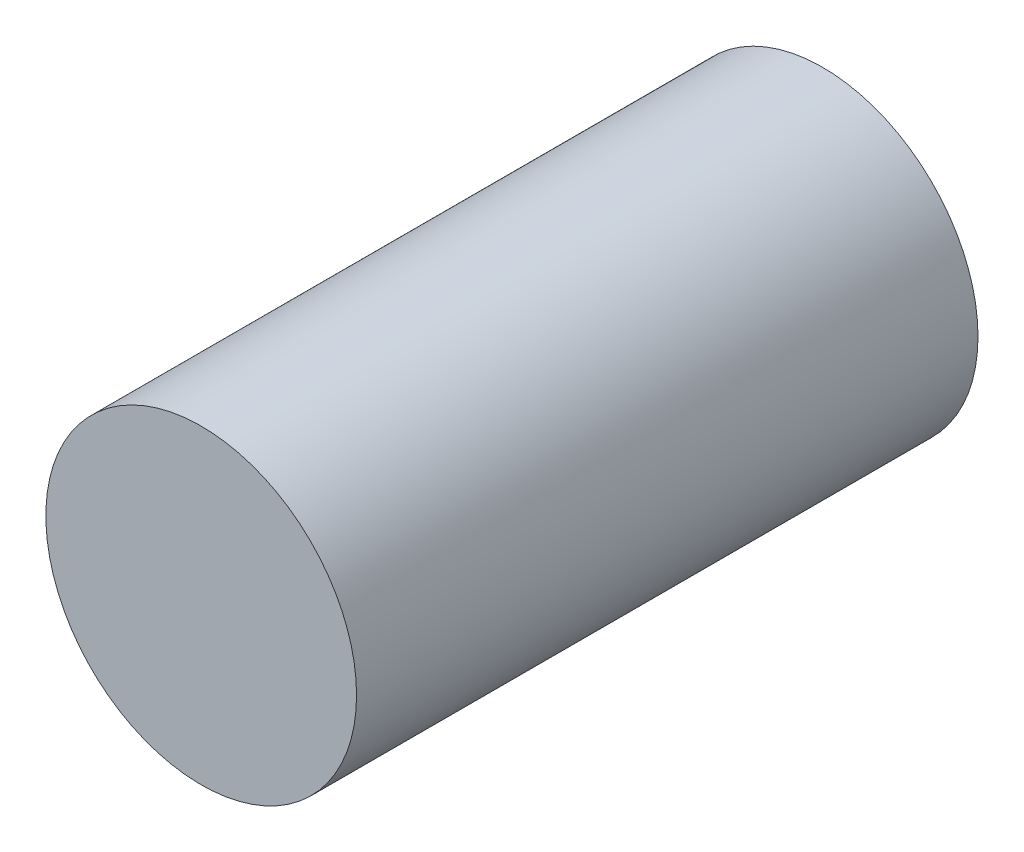
ISO-10303-21;
HEADER;
FILE_DESCRIPTION(('STEP AP214'),'2;1');
FILE_NAME('part.step','',(''),(''),'','','');
FILE_SCHEMA(('AUTOMOTIVE_DESIGN { 1 0 10303 214 1 1 1 1 }'));
ENDSEC;
DATA;
#1=APPLICATION_CONTEXT('core data for automotive mechanical design processes');
#2=APPLICATION_PROTOCOL_DEFINITION('international standard','automotive_design',2000,#1);
#3=PRODUCT_CONTEXT('',#1,'mechanical');
#4=PRODUCT('Part','Part','',(#3));
#5=PRODUCT_RELATED_PRODUCT_CATEGORY('part','',(#4));
#6=PRODUCT_DEFINITION_FORMATION('','',#4);
#7=PRODUCT_DEFINITION_CONTEXT('part definition',#1,'design');
#8=PRODUCT_DEFINITION('design','',#6,#7);
#9=PRODUCT_DEFINITION_SHAPE('','',#8);
#10=(LENGTH_UNIT() NAMED_UNIT(*) SI_UNIT(.MILLI.,.METRE.));
#11=(NAMED_UNIT(*) PLANE_ANGLE_UNIT() SI_UNIT($,.RADIAN.));
#12=(NAMED_UNIT(*) SI_UNIT($,.STERADIAN.) SOLID_ANGLE_UNIT());
#13=UNCERTAINTY_MEASURE_WITH_UNIT(LENGTH_MEASURE(1.E-05),#10,'distance_accuracy_value','');
#14=(GEOMETRIC_REPRESENTATION_CONTEXT(3) GLOBAL_UNCERTAINTY_ASSIGNED_CONTEXT((#13)) GLOBAL_UNIT_ASSIGNED_CONTEXT((#10,
#11,#12)) REPRESENTATION_CONTEXT('',''));
#15=CARTESIAN_POINT('',(0.,0.,0.));
#16=DIRECTION('',(0.,0.,1.));
#17=DIRECTION('',(1.,0.,0.));
#18=AXIS2_PLACEMENT_3D('',#15,#16,#17);
#19=CARTESIAN_POINT('',(0.,0.,101.6));
#20=DIRECTION('',(0.,0.,-1.));
#21=DIRECTION('',(-1.,0.,0.));
#22=AXIS2_PLACEMENT_3D('',#19,#20,#21);
#23=CYLINDRICAL_SURFACE('',#22,25.4);
#24=CARTESIAN_POINT('',(0.,0.,101.6));
#25=DIRECTION('',(0.,0.,1.));
#26=DIRECTION('',(1.,0.,0.));
#27=AXIS2_PLACEMENT_3D('',#24,#25,#26);
#28=CIRCLE('',#27,25.4);
#29=CARTESIAN_POINT('',(25.4,0.,101.6));
#30=VERTEX_POINT('',#29);
#31=EDGE_CURVE('E10',#30,#30,#28,.T.);
#32=ORIENTED_EDGE('',*,*,#31,.F.);
#33=EDGE_LOOP('',(#32));
#34=FACE_BOUND('',#33,.T.);
#35=CARTESIAN_POINT('',(0.,0.,0.));
#36=DIRECTION('',(0.,0.,1.));
#37=DIRECTION('',(1.,0.,0.));
#38=AXIS2_PLACEMENT_3D('',#35,#36,#37);
#39=CIRCLE('',#38,25.4);
#40=CARTESIAN_POINT('',(25.4,0.,0.));
#41=VERTEX_POINT('',#40);
#42=EDGE_CURVE('E40',#41,#41,#39,.T.);
#43=ORIENTED_EDGE('',*,*,#42,.T.);
#44=EDGE_LOOP('',(#43));
#45=FACE_BOUND('',#44,.T.);
#46=ADVANCED_FACE('F37',(#34,#45),#23,.T.);
#47=CARTESIAN_POINT('',(0.,0.,101.6));
#48=DIRECTION('',(0.,0.,1.));
#49=DIRECTION('',(1.,0.,0.));
#50=AXIS2_PLACEMENT_3D('',#47,#48,#49);
#51=PLANE('',#50);
#52=ORIENTED_EDGE('',*,*,#31,.T.);
#53=EDGE_LOOP('',(#52));
#54=FACE_BOUND('',#53,.T.);
#55=ADVANCED_FACE('F54',(#54),#51,.T.);
#56=CARTESIAN_POINT('',(0.,0.,0.));
#57=DIRECTION('',(0.,0.,1.));
#58=DIRECTION('',(1.,0.,0.));
#59=AXIS2_PLACEMENT_3D('',#56,#57,#58);
#60=PLANE('',#59);
#61=ORIENTED_EDGE('',*,*,#42,.F.);
#62=EDGE_LOOP('',(#61));
#63=FACE_BOUND('',#62,.T.);
#64=ADVANCED_FACE('F52',(#63),#60,.F.);
#65=CLOSED_SHELL('',(#46,#55,#64));
#66=MANIFOLD_SOLID_BREP('B2',#65);
#67=ADVANCED_BREP_SHAPE_REPRESENTATION('',(#18,#66),#14);
#68=SHAPE_DEFINITION_REPRESENTATION(#9,#67);
ENDSEC;
END-ISO-10303-21;
